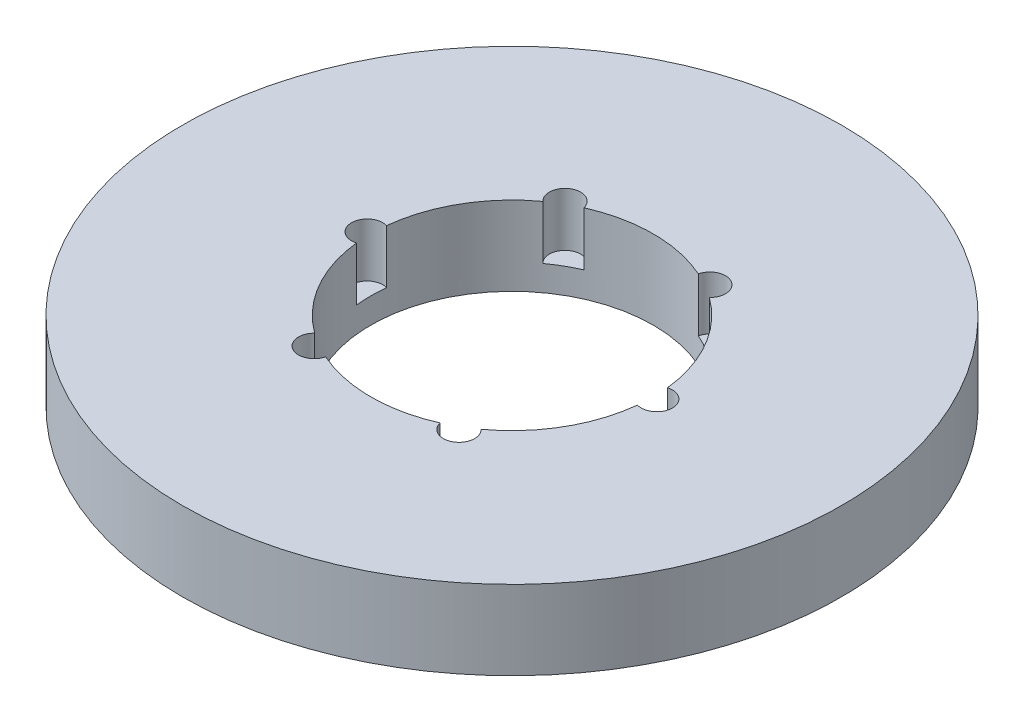
ISO-10303-21;
HEADER;
FILE_DESCRIPTION(('STEP AP214'),'2;1');
FILE_NAME('part.step','',(''),(''),'','','');
FILE_SCHEMA(('AUTOMOTIVE_DESIGN { 1 0 10303 214 1 1 1 1 }'));
ENDSEC;
DATA;
#1=APPLICATION_CONTEXT('core data for automotive mechanical design processes');
#2=APPLICATION_PROTOCOL_DEFINITION('international standard','automotive_design',2000,#1);
#3=PRODUCT_CONTEXT('',#1,'mechanical');
#4=PRODUCT('Part','Part','',(#3));
#5=PRODUCT_RELATED_PRODUCT_CATEGORY('part','',(#4));
#6=PRODUCT_DEFINITION_FORMATION('','',#4);
#7=PRODUCT_DEFINITION_CONTEXT('part definition',#1,'design');
#8=PRODUCT_DEFINITION('design','',#6,#7);
#9=PRODUCT_DEFINITION_SHAPE('','',#8);
#10=(LENGTH_UNIT() NAMED_UNIT(*) SI_UNIT(.MILLI.,.METRE.));
#11=(NAMED_UNIT(*) PLANE_ANGLE_UNIT() SI_UNIT($,.RADIAN.));
#12=(NAMED_UNIT(*) SI_UNIT($,.STERADIAN.) SOLID_ANGLE_UNIT());
#13=UNCERTAINTY_MEASURE_WITH_UNIT(LENGTH_MEASURE(1.E-05),#10,'distance_accuracy_value','');
#14=(GEOMETRIC_REPRESENTATION_CONTEXT(3) GLOBAL_UNCERTAINTY_ASSIGNED_CONTEXT((#13)) GLOBAL_UNIT_ASSIGNED_CONTEXT((#10,
#11,#12)) REPRESENTATION_CONTEXT('',''));
#15=CARTESIAN_POINT('',(0.,0.,0.));
#16=DIRECTION('',(0.,0.,1.));
#17=DIRECTION('',(1.,0.,0.));
#18=AXIS2_PLACEMENT_3D('',#15,#16,#17);
#19=CARTESIAN_POINT('',(0.,21.,0.));
#20=DIRECTION('',(0.,-1.,0.));
#21=DIRECTION('',(0.,0.,-1.));
#22=AXIS2_PLACEMENT_3D('',#19,#20,#21);
#23=CYLINDRICAL_SURFACE('',#22,87.5);
#24=CARTESIAN_POINT('',(0.,21.,0.));
#25=DIRECTION('',(0.,1.,0.));
#26=DIRECTION('',(0.,0.,1.));
#27=AXIS2_PLACEMENT_3D('',#24,#25,#26);
#28=CIRCLE('',#27,87.5);
#29=CARTESIAN_POINT('',(0.,21.,-87.5));
#30=VERTEX_POINT('',#29);
#31=EDGE_CURVE('E171',#30,#30,#28,.T.);
#32=CARTESIAN_POINT('',(0.,0.,0.));
#33=DIRECTION('',(0.,1.,0.));
#34=DIRECTION('',(0.,0.,1.));
#35=AXIS2_PLACEMENT_3D('',#32,#33,#34);
#36=CIRCLE('',#35,87.5);
#37=CARTESIAN_POINT('',(0.,0.,-87.5));
#38=VERTEX_POINT('',#37);
#39=EDGE_CURVE('E157',#38,#38,#36,.T.);
#40=CARTESIAN_POINT('',(0.,21.,-87.5));
#41=CARTESIAN_POINT('',(0.,20.78125,-87.5));
#42=CARTESIAN_POINT('',(0.,20.5625,-87.5));
#43=CARTESIAN_POINT('',(0.,20.125,-87.5));
#44=CARTESIAN_POINT('',(0.,19.90625,-87.5));
#45=CARTESIAN_POINT('',(0.,19.46875,-87.5));
#46=CARTESIAN_POINT('',(0.,19.25,-87.5));
#47=CARTESIAN_POINT('',(0.,18.8125,-87.5));
#48=CARTESIAN_POINT('',(0.,18.59375,-87.5));
#49=CARTESIAN_POINT('',(0.,18.15625,-87.5));
#50=CARTESIAN_POINT('',(0.,17.9375,-87.5));
#51=CARTESIAN_POINT('',(0.,17.5,-87.5));
#52=CARTESIAN_POINT('',(0.,17.28125,-87.5));
#53=CARTESIAN_POINT('',(0.,16.84375,-87.5));
#54=CARTESIAN_POINT('',(0.,16.625,-87.5));
#55=CARTESIAN_POINT('',(0.,16.1875,-87.5));
#56=CARTESIAN_POINT('',(0.,15.96875,-87.5));
#57=CARTESIAN_POINT('',(0.,15.53125,-87.5));
#58=CARTESIAN_POINT('',(0.,15.3125,-87.5));
#59=CARTESIAN_POINT('',(0.,14.875,-87.5));
#60=CARTESIAN_POINT('',(0.,14.65625,-87.5));
#61=CARTESIAN_POINT('',(0.,14.21875,-87.5));
#62=CARTESIAN_POINT('',(0.,14.,-87.5));
#63=CARTESIAN_POINT('',(0.,13.5625,-87.5));
#64=CARTESIAN_POINT('',(0.,13.34375,-87.5));
#65=CARTESIAN_POINT('',(0.,12.90625,-87.5));
#66=CARTESIAN_POINT('',(0.,12.6875,-87.5));
#67=CARTESIAN_POINT('',(0.,12.25,-87.5));
#68=CARTESIAN_POINT('',(0.,12.03125,-87.5));
#69=CARTESIAN_POINT('',(0.,11.59375,-87.5));
#70=CARTESIAN_POINT('',(0.,11.375,-87.5));
#71=CARTESIAN_POINT('',(0.,10.9375,-87.5));
#72=CARTESIAN_POINT('',(0.,10.71875,-87.5));
#73=CARTESIAN_POINT('',(0.,10.28125,-87.5));
#74=CARTESIAN_POINT('',(0.,10.0625,-87.5));
#75=CARTESIAN_POINT('',(0.,9.625,-87.5));
#76=CARTESIAN_POINT('',(0.,9.40625,-87.5));
#77=CARTESIAN_POINT('',(0.,8.96875,-87.5));
#78=CARTESIAN_POINT('',(0.,8.75,-87.5));
#79=CARTESIAN_POINT('',(0.,8.3125,-87.5));
#80=CARTESIAN_POINT('',(0.,8.09375,-87.5));
#81=CARTESIAN_POINT('',(0.,7.65625,-87.5));
#82=CARTESIAN_POINT('',(0.,7.4375,-87.5));
#83=CARTESIAN_POINT('',(0.,7.,-87.5));
#84=CARTESIAN_POINT('',(0.,6.78125,-87.5));
#85=CARTESIAN_POINT('',(0.,6.34375,-87.5));
#86=CARTESIAN_POINT('',(0.,6.125,-87.5));
#87=CARTESIAN_POINT('',(0.,5.6875,-87.5));
#88=CARTESIAN_POINT('',(0.,5.46875,-87.5));
#89=CARTESIAN_POINT('',(0.,5.03125,-87.5));
#90=CARTESIAN_POINT('',(0.,4.8125,-87.5));
#91=CARTESIAN_POINT('',(0.,4.375,-87.5));
#92=CARTESIAN_POINT('',(0.,4.15625,-87.5));
#93=CARTESIAN_POINT('',(0.,3.71875,-87.5));
#94=CARTESIAN_POINT('',(0.,3.5,-87.5));
#95=CARTESIAN_POINT('',(0.,3.0625,-87.5));
#96=CARTESIAN_POINT('',(0.,2.84375,-87.5));
#97=CARTESIAN_POINT('',(0.,2.40625,-87.5));
#98=CARTESIAN_POINT('',(0.,2.1875,-87.5));
#99=CARTESIAN_POINT('',(0.,1.75,-87.5));
#100=CARTESIAN_POINT('',(0.,1.53125,-87.5));
#101=CARTESIAN_POINT('',(0.,1.09375,-87.5));
#102=CARTESIAN_POINT('',(0.,0.875000000000001,-87.5));
#103=CARTESIAN_POINT('',(0.,0.4375,-87.5));
#104=CARTESIAN_POINT('',(0.,0.21875,-87.5));
#105=CARTESIAN_POINT('',(0.,0.,-87.5));
#106=B_SPLINE_CURVE_WITH_KNOTS('',3,(#40,#41,#42,#43,#44,#45,#46,#47,#48,#49,#50,#51,#52,#53,
#54,#55,#56,#57,#58,#59,#60,#61,#62,#63,#64,#65,#66,#67,#68,#69,#70,#71,#72,#73,#74,#75,#76,#77,
#78,#79,#80,#81,#82,#83,#84,#85,#86,#87,#88,#89,#90,#91,#92,#93,#94,#95,#96,#97,#98,#99,#100,
#101,#102,#103,#104,#105),.UNSPECIFIED.,.F.,.F.,(4,2,2,2,2,2,2,2,2,2,2,2,2,2,2,2,2,2,2,2,2,2,2,
2,2,2,2,2,2,2,2,2,4),(0.,0.656250000000001,1.3125,1.96875,2.625,3.28125,3.9375,4.59375,5.25,
5.90625,6.5625,7.21875,7.875,8.53125,9.1875,9.84375,10.5,11.15625,11.8125,12.46875,13.125,
13.78125,14.4375,15.09375,15.75,16.40625,17.0625,17.71875,18.375,19.03125,19.6875,20.34375,21.),.UNSPECIFIED.);
#107=EDGE_CURVE('BSEAM39',#30,#38,#106,.T.);
#108=ORIENTED_EDGE('',*,*,#31,.F.);
#109=ORIENTED_EDGE('',*,*,#39,.T.);
#110=ORIENTED_EDGE('',*,*,#107,.T.);
#111=ORIENTED_EDGE('',*,*,#107,.F.);
#112=EDGE_LOOP('',(#108,#110,#109,#111));
#113=FACE_BOUND('',#112,.T.);
#114=ADVANCED_FACE('F39',(#113),#23,.T.);
#115=CARTESIAN_POINT('',(0.,21.,0.));
#116=DIRECTION('',(0.,1.,0.));
#117=DIRECTION('',(0.,0.,1.));
#118=AXIS2_PLACEMENT_3D('',#115,#116,#117);
#119=PLANE('',#118);
#120=CARTESIAN_POINT('',(-19.2268393946881,21.,-33.3018627005657));
#121=DIRECTION('',(0.,1.,0.));
#122=DIRECTION('',(-0.866025403784433,0.,0.50000000000001));
#123=AXIS2_PLACEMENT_3D('',#120,#121,#122);
#124=CIRCLE('',#123,4.15451872316069);
#125=CARTESIAN_POINT('',(-15.1904602006517,21.,-34.2855642930434));
#126=VERTEX_POINT('',#125);
#127=CARTESIAN_POINT('',(-22.0969395605351,21.,-30.2981065754621));
#128=VERTEX_POINT('',#127);
#129=EDGE_CURVE('E214',#126,#128,#124,.T.);
#130=ORIENTED_EDGE('',*,*,#129,.F.);
#131=CARTESIAN_POINT('',(0.,21.,0.));
#132=DIRECTION('',(0.,1.,0.));
#133=DIRECTION('',(0.,0.,1.));
#134=AXIS2_PLACEMENT_3D('',#131,#132,#133);
#135=CIRCLE('',#134,37.5);
#136=CARTESIAN_POINT('',(15.190460200651,21.,-34.2855642930438));
#137=VERTEX_POINT('',#136);
#138=EDGE_CURVE('E272',#137,#126,#135,.T.);
#139=ORIENTED_EDGE('',*,*,#138,.F.);
#140=CARTESIAN_POINT('',(19.2268393946874,21.,-33.3018627005661));
#141=DIRECTION('',(0.,1.,0.));
#142=DIRECTION('',(-0.866025403784443,0.,-0.499999999999992));
#143=AXIS2_PLACEMENT_3D('',#140,#141,#142);
#144=CIRCLE('',#143,4.15451872316069);
#145=CARTESIAN_POINT('',(22.0969395605345,21.,-30.2981065754625));
#146=VERTEX_POINT('',#145);
#147=EDGE_CURVE('E285',#146,#137,#144,.T.);
#148=ORIENTED_EDGE('',*,*,#147,.F.);
#149=CARTESIAN_POINT('',(37.2873997611861,21.,-3.98745771758129));
#150=VERTEX_POINT('',#149);
#151=EDGE_CURVE('E165',#150,#146,#135,.T.);
#152=ORIENTED_EDGE('',*,*,#151,.F.);
#153=CARTESIAN_POINT('',(38.4536787893754,21.,0.));
#154=DIRECTION('',(0.,1.,0.));
#155=DIRECTION('',(0.,0.,-1.));
#156=AXIS2_PLACEMENT_3D('',#153,#154,#155);
#157=CIRCLE('',#156,4.15451872316069);
#158=CARTESIAN_POINT('',(37.2873997611861,21.,3.98745771758129));
#159=VERTEX_POINT('',#158);
#160=EDGE_CURVE('E281',#159,#150,#157,.T.);
#161=ORIENTED_EDGE('',*,*,#160,.F.);
#162=CARTESIAN_POINT('',(22.0969395605349,21.,30.2981065754622));
#163=VERTEX_POINT('',#162);
#164=EDGE_CURVE('E160',#163,#159,#135,.T.);
#165=ORIENTED_EDGE('',*,*,#164,.F.);
#166=CARTESIAN_POINT('',(19.2268393946879,21.,33.3018627005659));
#167=DIRECTION('',(0.,1.,0.));
#168=DIRECTION('',(0.866025403784436,0.,-0.500000000000004));
#169=AXIS2_PLACEMENT_3D('',#166,#167,#168);
#170=CIRCLE('',#169,4.15451872316069);
#171=CARTESIAN_POINT('',(15.1904602006515,21.,34.2855642930435));
#172=VERTEX_POINT('',#171);
#173=EDGE_CURVE('E154',#172,#163,#170,.T.);
#174=ORIENTED_EDGE('',*,*,#173,.F.);
#175=CARTESIAN_POINT('',(-15.1904602006513,21.,34.2855642930437));
#176=VERTEX_POINT('',#175);
#177=EDGE_CURVE('E150',#176,#172,#135,.T.);
#178=ORIENTED_EDGE('',*,*,#177,.F.);
#179=CARTESIAN_POINT('',(-19.2268393946876,21.,33.301862700566));
#180=DIRECTION('',(0.,1.,0.));
#181=DIRECTION('',(0.86602540378444,0.,0.499999999999998));
#182=AXIS2_PLACEMENT_3D('',#179,#180,#181);
#183=CIRCLE('',#182,4.15451872316069);
#184=CARTESIAN_POINT('',(-22.0969395605347,21.,30.2981065754624));
#185=VERTEX_POINT('',#184);
#186=EDGE_CURVE('E127',#185,#176,#183,.T.);
#187=ORIENTED_EDGE('',*,*,#186,.F.);
#188=CARTESIAN_POINT('',(-37.2873997611861,21.,3.98745771758129));
#189=VERTEX_POINT('',#188);
#190=EDGE_CURVE('E156',#189,#185,#135,.T.);
#191=ORIENTED_EDGE('',*,*,#190,.F.);
#192=CARTESIAN_POINT('',(-38.4536787893754,21.,0.));
#193=DIRECTION('',(0.,1.,0.));
#194=DIRECTION('',(0.,0.,1.));
#195=AXIS2_PLACEMENT_3D('',#192,#193,#194);
#196=CIRCLE('',#195,4.15451872316069);
#197=CARTESIAN_POINT('',(-37.2873997611861,21.,-3.98745771758129));
#198=VERTEX_POINT('',#197);
#199=EDGE_CURVE('E164',#198,#189,#196,.T.);
#200=ORIENTED_EDGE('',*,*,#199,.F.);
#201=EDGE_CURVE('E159',#128,#198,#135,.T.);
#202=ORIENTED_EDGE('',*,*,#201,.F.);
#203=EDGE_LOOP('',(#130,#139,#148,#152,#161,#165,#174,#178,#187,#191,#200,#202));
#204=FACE_BOUND('',#203,.T.);
#205=ORIENTED_EDGE('',*,*,#31,.T.);
#206=EDGE_LOOP('',(#205));
#207=FACE_BOUND('',#206,.T.);
#208=ADVANCED_FACE('F155',(#204,#207),#119,.T.);
#209=CARTESIAN_POINT('',(0.,0.,0.));
#210=DIRECTION('',(0.,1.,0.));
#211=DIRECTION('',(0.,0.,1.));
#212=AXIS2_PLACEMENT_3D('',#209,#210,#211);
#213=PLANE('',#212);
#214=CARTESIAN_POINT('',(0.,0.,0.));
#215=DIRECTION('',(0.,1.,0.));
#216=DIRECTION('',(0.,0.,1.));
#217=AXIS2_PLACEMENT_3D('',#214,#215,#216);
#218=CIRCLE('',#217,37.5);
#219=CARTESIAN_POINT('',(0.,0.,37.5));
#220=VERTEX_POINT('',#219);
#221=EDGE_CURVE('E170',#220,#220,#218,.T.);
#222=ORIENTED_EDGE('',*,*,#221,.T.);
#223=EDGE_LOOP('',(#222));
#224=FACE_BOUND('',#223,.T.);
#225=ORIENTED_EDGE('',*,*,#39,.F.);
#226=EDGE_LOOP('',(#225));
#227=FACE_BOUND('',#226,.T.);
#228=ADVANCED_FACE('F232',(#224,#227),#213,.F.);
#229=CARTESIAN_POINT('',(0.,21.,0.));
#230=DIRECTION('',(0.,-1.,0.));
#231=DIRECTION('',(0.,0.,-1.));
#232=AXIS2_PLACEMENT_3D('',#229,#230,#231);
#233=CYLINDRICAL_SURFACE('',#232,37.5);
#234=DIRECTION('',(0.,1.,0.));
#235=VECTOR('',#234,1.);
#236=CARTESIAN_POINT('',(-15.1904602006517,13.8657680705318,-34.2855642930434));
#237=LINE('',#236,#235);
#238=CARTESIAN_POINT('',(-15.1904602006517,6.73153614106358,-34.2855642930434));
#239=VERTEX_POINT('',#238);
#240=EDGE_CURVE('E11',#239,#126,#237,.T.);
#241=ORIENTED_EDGE('',*,*,#240,.F.);
#242=CARTESIAN_POINT('',(0.,6.73153614106358,0.));
#243=DIRECTION('',(0.,1.,0.));
#244=DIRECTION('',(0.,0.,1.));
#245=AXIS2_PLACEMENT_3D('',#242,#243,#244);
#246=CIRCLE('',#245,37.5);
#247=CARTESIAN_POINT('',(-22.0969395605351,6.73153614106358,-30.2981065754621));
#248=VERTEX_POINT('',#247);
#249=EDGE_CURVE('E209',#239,#248,#246,.T.);
#250=ORIENTED_EDGE('',*,*,#249,.T.);
#251=DIRECTION('',(0.,1.,0.));
#252=VECTOR('',#251,1.);
#253=CARTESIAN_POINT('',(-22.0969395605351,13.8657680705318,-30.2981065754621));
#254=LINE('',#253,#252);
#255=EDGE_CURVE('E46',#128,#248,#254,.F.);
#256=ORIENTED_EDGE('',*,*,#255,.F.);
#257=ORIENTED_EDGE('',*,*,#201,.T.);
#258=DIRECTION('',(0.,1.,0.));
#259=VECTOR('',#258,1.);
#260=CARTESIAN_POINT('',(-37.2873997611861,13.8657680705318,-3.98745771758128));
#261=LINE('',#260,#259);
#262=CARTESIAN_POINT('',(-37.2873997611861,6.73153614106358,-3.98745771758129));
#263=VERTEX_POINT('',#262);
#264=EDGE_CURVE('E185',#263,#198,#261,.T.);
#265=ORIENTED_EDGE('',*,*,#264,.F.);
#266=CARTESIAN_POINT('',(0.,6.73153614106358,0.));
#267=DIRECTION('',(0.,1.,0.));
#268=DIRECTION('',(0.,0.,1.));
#269=AXIS2_PLACEMENT_3D('',#266,#267,#268);
#270=CIRCLE('',#269,37.5);
#271=CARTESIAN_POINT('',(-37.2873997611861,6.73153614106358,3.98745771758129));
#272=VERTEX_POINT('',#271);
#273=EDGE_CURVE('E173',#263,#272,#270,.T.);
#274=ORIENTED_EDGE('',*,*,#273,.T.);
#275=DIRECTION('',(0.,1.,0.));
#276=VECTOR('',#275,1.);
#277=CARTESIAN_POINT('',(-37.2873997611861,13.8657680705318,3.98745771758128));
#278=LINE('',#277,#276);
#279=EDGE_CURVE('E178',#189,#272,#278,.F.);
#280=ORIENTED_EDGE('',*,*,#279,.F.);
#281=ORIENTED_EDGE('',*,*,#190,.T.);
#282=DIRECTION('',(0.,1.,0.));
#283=VECTOR('',#282,1.);
#284=CARTESIAN_POINT('',(-22.0969395605347,13.8657680705318,30.2981065754624));
#285=LINE('',#284,#283);
#286=CARTESIAN_POINT('',(-22.0969395605347,6.73153614106358,30.2981065754624));
#287=VERTEX_POINT('',#286);
#288=EDGE_CURVE('E132',#287,#185,#285,.T.);
#289=ORIENTED_EDGE('',*,*,#288,.F.);
#290=CARTESIAN_POINT('',(0.,6.73153614106358,0.));
#291=DIRECTION('',(0.,1.,0.));
#292=DIRECTION('',(0.,0.,1.));
#293=AXIS2_PLACEMENT_3D('',#290,#291,#292);
#294=CIRCLE('',#293,37.5);
#295=CARTESIAN_POINT('',(-15.1904602006513,6.73153614106358,34.2855642930437));
#296=VERTEX_POINT('',#295);
#297=EDGE_CURVE('E146',#287,#296,#294,.T.);
#298=ORIENTED_EDGE('',*,*,#297,.T.);
#299=DIRECTION('',(0.,1.,0.));
#300=VECTOR('',#299,1.);
#301=CARTESIAN_POINT('',(-15.1904602006513,13.8657680705318,34.2855642930437));
#302=LINE('',#301,#300);
#303=EDGE_CURVE('E128',#176,#296,#302,.F.);
#304=ORIENTED_EDGE('',*,*,#303,.F.);
#305=ORIENTED_EDGE('',*,*,#177,.T.);
#306=DIRECTION('',(0.,1.,0.));
#307=VECTOR('',#306,1.);
#308=CARTESIAN_POINT('',(15.1904602006515,13.8657680705318,34.2855642930435));
#309=LINE('',#308,#307);
#310=CARTESIAN_POINT('',(15.1904602006515,6.73153614106358,34.2855642930435));
#311=VERTEX_POINT('',#310);
#312=EDGE_CURVE('E192',#311,#172,#309,.T.);
#313=ORIENTED_EDGE('',*,*,#312,.F.);
#314=CARTESIAN_POINT('',(0.,6.73153614106358,0.));
#315=DIRECTION('',(0.,1.,0.));
#316=DIRECTION('',(0.,0.,1.));
#317=AXIS2_PLACEMENT_3D('',#314,#315,#316);
#318=CIRCLE('',#317,37.5);
#319=CARTESIAN_POINT('',(22.0969395605349,6.73153614106358,30.2981065754622));
#320=VERTEX_POINT('',#319);
#321=EDGE_CURVE('E190',#311,#320,#318,.T.);
#322=ORIENTED_EDGE('',*,*,#321,.T.);
#323=DIRECTION('',(0.,1.,0.));
#324=VECTOR('',#323,1.);
#325=CARTESIAN_POINT('',(22.0969395605349,13.8657680705318,30.2981065754622));
#326=LINE('',#325,#324);
#327=EDGE_CURVE('E189',#163,#320,#326,.F.);
#328=ORIENTED_EDGE('',*,*,#327,.F.);
#329=ORIENTED_EDGE('',*,*,#164,.T.);
#330=DIRECTION('',(0.,1.,0.));
#331=VECTOR('',#330,1.);
#332=CARTESIAN_POINT('',(37.2873997611861,13.8657680705318,3.98745771758128));
#333=LINE('',#332,#331);
#334=CARTESIAN_POINT('',(37.2873997611861,6.73153614106358,3.98745771758129));
#335=VERTEX_POINT('',#334);
#336=EDGE_CURVE('E203',#335,#159,#333,.T.);
#337=ORIENTED_EDGE('',*,*,#336,.F.);
#338=CARTESIAN_POINT('',(0.,6.73153614106358,0.));
#339=DIRECTION('',(0.,1.,0.));
#340=DIRECTION('',(0.,0.,1.));
#341=AXIS2_PLACEMENT_3D('',#338,#339,#340);
#342=CIRCLE('',#341,37.5);
#343=CARTESIAN_POINT('',(37.2873997611861,6.73153614106358,-3.98745771758129));
#344=VERTEX_POINT('',#343);
#345=EDGE_CURVE('E194',#335,#344,#342,.T.);
#346=ORIENTED_EDGE('',*,*,#345,.T.);
#347=DIRECTION('',(0.,1.,0.));
#348=VECTOR('',#347,1.);
#349=CARTESIAN_POINT('',(37.2873997611861,13.8657680705318,-3.98745771758128));
#350=LINE('',#349,#348);
#351=EDGE_CURVE('E196',#150,#344,#350,.F.);
#352=ORIENTED_EDGE('',*,*,#351,.F.);
#353=ORIENTED_EDGE('',*,*,#151,.T.);
#354=DIRECTION('',(0.,1.,0.));
#355=VECTOR('',#354,1.);
#356=CARTESIAN_POINT('',(22.0969395605345,13.8657680705318,-30.2981065754625));
#357=LINE('',#356,#355);
#358=CARTESIAN_POINT('',(22.0969395605345,6.73153614106358,-30.2981065754625));
#359=VERTEX_POINT('',#358);
#360=EDGE_CURVE('E208',#359,#146,#357,.T.);
#361=ORIENTED_EDGE('',*,*,#360,.F.);
#362=CARTESIAN_POINT('',(0.,6.73153614106358,0.));
#363=DIRECTION('',(0.,1.,0.));
#364=DIRECTION('',(0.,0.,1.));
#365=AXIS2_PLACEMENT_3D('',#362,#363,#364);
#366=CIRCLE('',#365,37.5);
#367=CARTESIAN_POINT('',(15.190460200651,6.73153614106358,-34.2855642930438));
#368=VERTEX_POINT('',#367);
#369=EDGE_CURVE('E201',#359,#368,#366,.T.);
#370=ORIENTED_EDGE('',*,*,#369,.T.);
#371=DIRECTION('',(0.,1.,0.));
#372=VECTOR('',#371,1.);
#373=CARTESIAN_POINT('',(15.190460200651,13.8657680705318,-34.2855642930438));
#374=LINE('',#373,#372);
#375=EDGE_CURVE('E206',#137,#368,#374,.F.);
#376=ORIENTED_EDGE('',*,*,#375,.F.);
#377=ORIENTED_EDGE('',*,*,#138,.T.);
#378=EDGE_LOOP('',(#241,#250,#256,#257,#265,#274,#280,#281,#289,#298,#304,#305,#313,#322,#328,
#329,#337,#346,#352,#353,#361,#370,#376,#377));
#379=FACE_BOUND('',#378,.T.);
#380=ORIENTED_EDGE('',*,*,#221,.F.);
#381=EDGE_LOOP('',(#380));
#382=FACE_BOUND('',#381,.T.);
#383=ADVANCED_FACE('F145',(#379,#382),#233,.F.);
#384=CARTESIAN_POINT('',(-38.4536787893754,6.73153614106358,0.));
#385=DIRECTION('',(0.,1.,0.));
#386=DIRECTION('',(0.,0.,1.));
#387=AXIS2_PLACEMENT_3D('',#384,#385,#386);
#388=CYLINDRICAL_SURFACE('',#387,4.15451872316069);
#389=ORIENTED_EDGE('',*,*,#264,.T.);
#390=ORIENTED_EDGE('',*,*,#199,.T.);
#391=ORIENTED_EDGE('',*,*,#279,.T.);
#392=CARTESIAN_POINT('',(-38.4536787893754,6.73153614106358,0.));
#393=DIRECTION('',(0.,1.,0.));
#394=DIRECTION('',(0.,0.,1.));
#395=AXIS2_PLACEMENT_3D('',#392,#393,#394);
#396=CIRCLE('',#395,4.15451872316069);
#397=EDGE_CURVE('E168',#263,#272,#396,.T.);
#398=ORIENTED_EDGE('',*,*,#397,.F.);
#399=EDGE_LOOP('',(#389,#390,#391,#398));
#400=FACE_BOUND('',#399,.T.);
#401=ADVANCED_FACE('F243',(#400),#388,.F.);
#402=CARTESIAN_POINT('',(-38.4536787893754,6.73153614106358,0.));
#403=DIRECTION('',(0.,1.,0.));
#404=DIRECTION('',(0.,0.,1.));
#405=AXIS2_PLACEMENT_3D('',#402,#403,#404);
#406=PLANE('',#405);
#407=ORIENTED_EDGE('',*,*,#397,.T.);
#408=ORIENTED_EDGE('',*,*,#273,.F.);
#409=EDGE_LOOP('',(#407,#408));
#410=FACE_BOUND('',#409,.T.);
#411=ADVANCED_FACE('F247',(#410),#406,.T.);
#412=CARTESIAN_POINT('',(-19.2268393946876,6.73153614106358,33.301862700566));
#413=DIRECTION('',(0.,1.,0.));
#414=DIRECTION('',(0.,0.,1.));
#415=AXIS2_PLACEMENT_3D('',#412,#413,#414);
#416=CYLINDRICAL_SURFACE('',#415,4.15451872316069);
#417=ORIENTED_EDGE('',*,*,#288,.T.);
#418=ORIENTED_EDGE('',*,*,#186,.T.);
#419=ORIENTED_EDGE('',*,*,#303,.T.);
#420=CARTESIAN_POINT('',(-19.2268393946876,6.73153614106358,33.301862700566));
#421=DIRECTION('',(0.,1.,0.));
#422=DIRECTION('',(0.86602540378444,0.,0.499999999999998));
#423=AXIS2_PLACEMENT_3D('',#420,#421,#422);
#424=CIRCLE('',#423,4.15451872316069);
#425=EDGE_CURVE('E137',#287,#296,#424,.T.);
#426=ORIENTED_EDGE('',*,*,#425,.F.);
#427=EDGE_LOOP('',(#417,#418,#419,#426));
#428=FACE_BOUND('',#427,.T.);
#429=ADVANCED_FACE('F126',(#428),#416,.F.);
#430=CARTESIAN_POINT('',(-19.2268393946876,6.73153614106358,33.301862700566));
#431=DIRECTION('',(0.,1.,0.));
#432=DIRECTION('',(0.86602540378444,0.,0.499999999999998));
#433=AXIS2_PLACEMENT_3D('',#430,#431,#432);
#434=PLANE('',#433);
#435=ORIENTED_EDGE('',*,*,#425,.T.);
#436=ORIENTED_EDGE('',*,*,#297,.F.);
#437=EDGE_LOOP('',(#435,#436));
#438=FACE_BOUND('',#437,.T.);
#439=ADVANCED_FACE('F254',(#438),#434,.T.);
#440=CARTESIAN_POINT('',(19.2268393946879,6.73153614106358,33.3018627005659));
#441=DIRECTION('',(0.,1.,0.));
#442=DIRECTION('',(0.,0.,1.));
#443=AXIS2_PLACEMENT_3D('',#440,#441,#442);
#444=CYLINDRICAL_SURFACE('',#443,4.15451872316069);
#445=ORIENTED_EDGE('',*,*,#312,.T.);
#446=ORIENTED_EDGE('',*,*,#173,.T.);
#447=ORIENTED_EDGE('',*,*,#327,.T.);
#448=CARTESIAN_POINT('',(19.2268393946879,6.73153614106358,33.3018627005659));
#449=DIRECTION('',(0.,1.,0.));
#450=DIRECTION('',(0.866025403784436,0.,-0.500000000000004));
#451=AXIS2_PLACEMENT_3D('',#448,#449,#450);
#452=CIRCLE('',#451,4.15451872316069);
#453=EDGE_CURVE('E138',#311,#320,#452,.T.);
#454=ORIENTED_EDGE('',*,*,#453,.F.);
#455=EDGE_LOOP('',(#445,#446,#447,#454));
#456=FACE_BOUND('',#455,.T.);
#457=ADVANCED_FACE('F260',(#456),#444,.F.);
#458=CARTESIAN_POINT('',(19.2268393946879,6.73153614106358,33.3018627005659));
#459=DIRECTION('',(0.,1.,0.));
#460=DIRECTION('',(0.866025403784436,0.,-0.500000000000004));
#461=AXIS2_PLACEMENT_3D('',#458,#459,#460);
#462=PLANE('',#461);
#463=ORIENTED_EDGE('',*,*,#453,.T.);
#464=ORIENTED_EDGE('',*,*,#321,.F.);
#465=EDGE_LOOP('',(#463,#464));
#466=FACE_BOUND('',#465,.T.);
#467=ADVANCED_FACE('F265',(#466),#462,.T.);
#468=CARTESIAN_POINT('',(38.4536787893754,6.73153614106358,0.));
#469=DIRECTION('',(0.,1.,0.));
#470=DIRECTION('',(0.,0.,1.));
#471=AXIS2_PLACEMENT_3D('',#468,#469,#470);
#472=CYLINDRICAL_SURFACE('',#471,4.15451872316069);
#473=ORIENTED_EDGE('',*,*,#336,.T.);
#474=ORIENTED_EDGE('',*,*,#160,.T.);
#475=ORIENTED_EDGE('',*,*,#351,.T.);
#476=CARTESIAN_POINT('',(38.4536787893754,6.73153614106358,0.));
#477=DIRECTION('',(0.,1.,0.));
#478=DIRECTION('',(0.,0.,-1.));
#479=AXIS2_PLACEMENT_3D('',#476,#477,#478);
#480=CIRCLE('',#479,4.15451872316069);
#481=EDGE_CURVE('E287',#335,#344,#480,.T.);
#482=ORIENTED_EDGE('',*,*,#481,.F.);
#483=EDGE_LOOP('',(#473,#474,#475,#482));
#484=FACE_BOUND('',#483,.T.);
#485=ADVANCED_FACE('F300',(#484),#472,.F.);
#486=CARTESIAN_POINT('',(38.4536787893754,6.73153614106358,0.));
#487=DIRECTION('',(0.,1.,0.));
#488=DIRECTION('',(0.,0.,-1.));
#489=AXIS2_PLACEMENT_3D('',#486,#487,#488);
#490=PLANE('',#489);
#491=ORIENTED_EDGE('',*,*,#481,.T.);
#492=ORIENTED_EDGE('',*,*,#345,.F.);
#493=EDGE_LOOP('',(#491,#492));
#494=FACE_BOUND('',#493,.T.);
#495=ADVANCED_FACE('F298',(#494),#490,.T.);
#496=CARTESIAN_POINT('',(19.2268393946874,6.73153614106358,-33.3018627005661));
#497=DIRECTION('',(0.,1.,0.));
#498=DIRECTION('',(0.,0.,1.));
#499=AXIS2_PLACEMENT_3D('',#496,#497,#498);
#500=CYLINDRICAL_SURFACE('',#499,4.15451872316069);
#501=ORIENTED_EDGE('',*,*,#360,.T.);
#502=ORIENTED_EDGE('',*,*,#147,.T.);
#503=ORIENTED_EDGE('',*,*,#375,.T.);
#504=CARTESIAN_POINT('',(19.2268393946874,6.73153614106358,-33.3018627005661));
#505=DIRECTION('',(0.,1.,0.));
#506=DIRECTION('',(-0.866025403784443,0.,-0.499999999999992));
#507=AXIS2_PLACEMENT_3D('',#504,#505,#506);
#508=CIRCLE('',#507,4.15451872316069);
#509=EDGE_CURVE('E56',#359,#368,#508,.T.);
#510=ORIENTED_EDGE('',*,*,#509,.F.);
#511=EDGE_LOOP('',(#501,#502,#503,#510));
#512=FACE_BOUND('',#511,.T.);
#513=ADVANCED_FACE('F301',(#512),#500,.F.);
#514=CARTESIAN_POINT('',(19.2268393946874,6.73153614106358,-33.3018627005661));
#515=DIRECTION('',(0.,1.,0.));
#516=DIRECTION('',(-0.866025403784443,0.,-0.499999999999992));
#517=AXIS2_PLACEMENT_3D('',#514,#515,#516);
#518=PLANE('',#517);
#519=ORIENTED_EDGE('',*,*,#509,.T.);
#520=ORIENTED_EDGE('',*,*,#369,.F.);
#521=EDGE_LOOP('',(#519,#520));
#522=FACE_BOUND('',#521,.T.);
#523=ADVANCED_FACE('F221',(#522),#518,.T.);
#524=CARTESIAN_POINT('',(-19.2268393946881,6.73153614106358,-33.3018627005657));
#525=DIRECTION('',(0.,1.,0.));
#526=DIRECTION('',(0.,0.,1.));
#527=AXIS2_PLACEMENT_3D('',#524,#525,#526);
#528=CYLINDRICAL_SURFACE('',#527,4.15451872316069);
#529=ORIENTED_EDGE('',*,*,#240,.T.);
#530=ORIENTED_EDGE('',*,*,#129,.T.);
#531=ORIENTED_EDGE('',*,*,#255,.T.);
#532=CARTESIAN_POINT('',(-19.2268393946881,6.73153614106358,-33.3018627005657));
#533=DIRECTION('',(0.,1.,0.));
#534=DIRECTION('',(-0.866025403784433,0.,0.50000000000001));
#535=AXIS2_PLACEMENT_3D('',#532,#533,#534);
#536=CIRCLE('',#535,4.15451872316069);
#537=EDGE_CURVE('E55',#239,#248,#536,.T.);
#538=ORIENTED_EDGE('',*,*,#537,.F.);
#539=EDGE_LOOP('',(#529,#530,#531,#538));
#540=FACE_BOUND('',#539,.T.);
#541=ADVANCED_FACE('F212',(#540),#528,.F.);
#542=CARTESIAN_POINT('',(-19.2268393946881,6.73153614106358,-33.3018627005657));
#543=DIRECTION('',(0.,1.,0.));
#544=DIRECTION('',(-0.866025403784433,0.,0.50000000000001));
#545=AXIS2_PLACEMENT_3D('',#542,#543,#544);
#546=PLANE('',#545);
#547=ORIENTED_EDGE('',*,*,#537,.T.);
#548=ORIENTED_EDGE('',*,*,#249,.F.);
#549=EDGE_LOOP('',(#547,#548));
#550=FACE_BOUND('',#549,.T.);
#551=ADVANCED_FACE('F217',(#550),#546,.T.);
#552=CLOSED_SHELL('',(#114,#208,#228,#383,#401,#411,#429,#439,#457,#467,#485,#495,#513,#523,
#541,#551));
#553=MANIFOLD_SOLID_BREP('B2',#552);
#554=ADVANCED_BREP_SHAPE_REPRESENTATION('',(#18,#553),#14);
#555=SHAPE_DEFINITION_REPRESENTATION(#9,#554);
ENDSEC;
END-ISO-10303-21;
